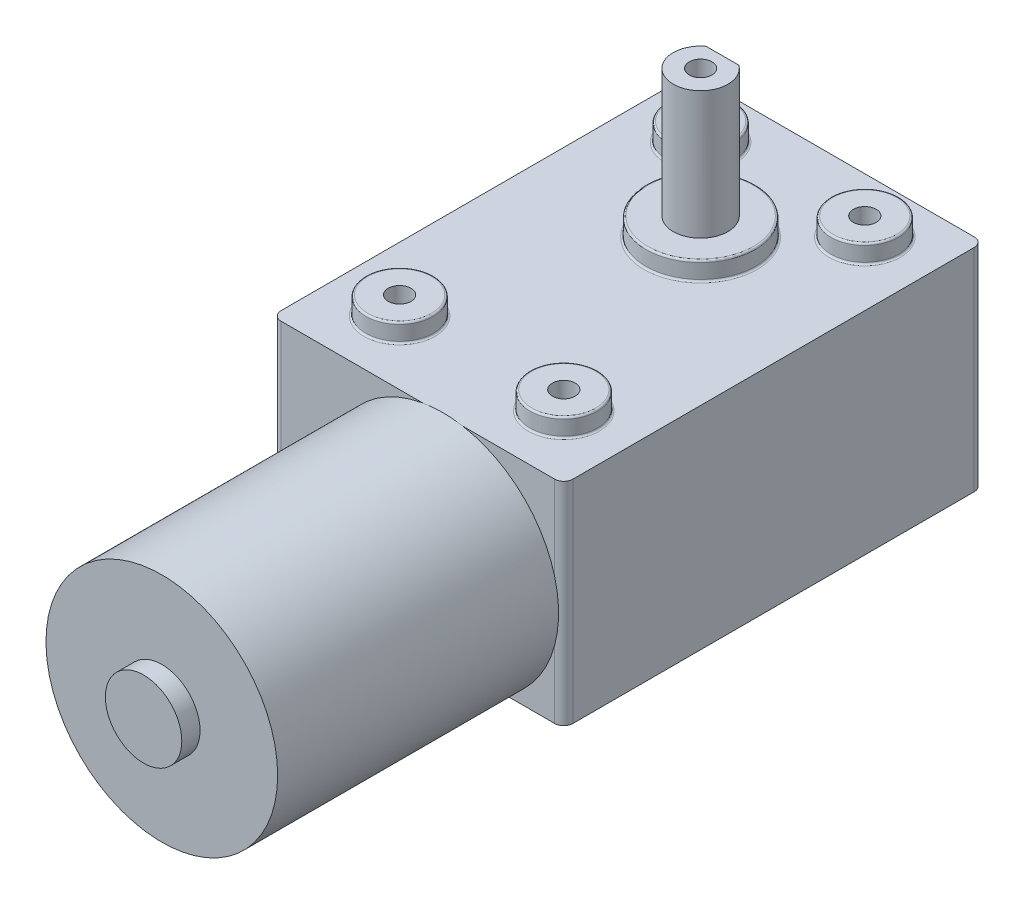
ISO-10303-21;
HEADER;
FILE_DESCRIPTION(('STEP AP214'),'2;1');
FILE_NAME('part.step','',(''),(''),'','','');
FILE_SCHEMA(('AUTOMOTIVE_DESIGN { 1 0 10303 214 1 1 1 1 }'));
ENDSEC;
DATA;
#1=APPLICATION_CONTEXT('core data for automotive mechanical design processes');
#2=APPLICATION_PROTOCOL_DEFINITION('international standard','automotive_design',2000,#1);
#3=PRODUCT_CONTEXT('',#1,'mechanical');
#4=PRODUCT('Part','Part','',(#3));
#5=PRODUCT_RELATED_PRODUCT_CATEGORY('part','',(#4));
#6=PRODUCT_DEFINITION_FORMATION('','',#4);
#7=PRODUCT_DEFINITION_CONTEXT('part definition',#1,'design');
#8=PRODUCT_DEFINITION('design','',#6,#7);
#9=PRODUCT_DEFINITION_SHAPE('','',#8);
#10=(LENGTH_UNIT() NAMED_UNIT(*) SI_UNIT(.MILLI.,.METRE.));
#11=(NAMED_UNIT(*) PLANE_ANGLE_UNIT() SI_UNIT($,.RADIAN.));
#12=(NAMED_UNIT(*) SI_UNIT($,.STERADIAN.) SOLID_ANGLE_UNIT());
#13=UNCERTAINTY_MEASURE_WITH_UNIT(LENGTH_MEASURE(1.E-05),#10,'distance_accuracy_value','');
#14=(GEOMETRIC_REPRESENTATION_CONTEXT(3) GLOBAL_UNCERTAINTY_ASSIGNED_CONTEXT((#13)) GLOBAL_UNIT_ASSIGNED_CONTEXT((#10,
#11,#12)) REPRESENTATION_CONTEXT('',''));
#15=CARTESIAN_POINT('',(0.,0.,0.));
#16=DIRECTION('',(0.,0.,1.));
#17=DIRECTION('',(1.,0.,0.));
#18=AXIS2_PLACEMENT_3D('',#15,#16,#17);
#19=CARTESIAN_POINT('',(0.,23.2,0.));
#20=DIRECTION('',(0.,0.,-1.));
#21=DIRECTION('',(-1.,0.,0.));
#22=AXIS2_PLACEMENT_3D('',#19,#20,#21);
#23=PLANE('',#22);
#24=CARTESIAN_POINT('',(18.7297984360643,10.6881933027604,0.));
#25=DIRECTION('',(0.,0.,1.));
#26=DIRECTION('',(1.,0.,0.));
#27=AXIS2_PLACEMENT_3D('',#24,#25,#26);
#28=CIRCLE('',#27,12.7);
#29=CARTESIAN_POINT('',(25.5892826676103,0.,0.));
#30=VERTEX_POINT('',#29);
#31=CARTESIAN_POINT('',(31.,7.4121967245584,0.));
#32=VERTEX_POINT('',#31);
#33=EDGE_CURVE('E176',#30,#32,#28,.T.);
#34=ORIENTED_EDGE('',*,*,#33,.F.);
#35=DIRECTION('',(1.,0.,0.));
#36=VECTOR('',#35,1.);
#37=CARTESIAN_POINT('',(0.,0.,0.));
#38=LINE('',#37,#36);
#39=CARTESIAN_POINT('',(31.,-1.2490009027033E-13,0.));
#40=VERTEX_POINT('',#39);
#41=EDGE_CURVE('E252',#30,#40,#38,.T.);
#42=ORIENTED_EDGE('',*,*,#41,.T.);
#43=DIRECTION('',(0.,-1.,0.));
#44=VECTOR('',#43,1.);
#45=CARTESIAN_POINT('',(31.,23.2,0.));
#46=LINE('',#45,#44);
#47=EDGE_CURVE('E159',#40,#32,#46,.F.);
#48=ORIENTED_EDGE('',*,*,#47,.T.);
#49=EDGE_LOOP('',(#34,#42,#48));
#50=FACE_BOUND('',#49,.T.);
#51=ADVANCED_FACE('F36',(#50),#23,.F.);
#52=CARTESIAN_POINT('',(31.,13.9641898809621,0.));
#53=VERTEX_POINT('',#52);
#54=CARTESIAN_POINT('',(20.9080300975067,23.2,0.));
#55=VERTEX_POINT('',#54);
#56=EDGE_CURVE('E161',#53,#55,#28,.T.);
#57=ORIENTED_EDGE('',*,*,#56,.F.);
#58=CARTESIAN_POINT('',(31.,23.2,0.));
#59=VERTEX_POINT('',#58);
#60=EDGE_CURVE('E149',#53,#59,#46,.F.);
#61=ORIENTED_EDGE('',*,*,#60,.T.);
#62=DIRECTION('',(1.,0.,0.));
#63=VECTOR('',#62,1.);
#64=CARTESIAN_POINT('',(0.,23.2,0.));
#65=LINE('',#64,#63);
#66=EDGE_CURVE('E52',#55,#59,#65,.T.);
#67=ORIENTED_EDGE('',*,*,#66,.F.);
#68=EDGE_LOOP('',(#57,#61,#67));
#69=FACE_BOUND('',#68,.T.);
#70=ADVANCED_FACE('F162',(#69),#23,.F.);
#71=CARTESIAN_POINT('',(0.,23.2,0.));
#72=DIRECTION('',(1.,0.,0.));
#73=DIRECTION('',(0.,0.,-1.));
#74=AXIS2_PLACEMENT_3D('',#71,#72,#73);
#75=PLANE('',#74);
#76=DIRECTION('',(0.,0.,1.));
#77=VECTOR('',#76,1.);
#78=CARTESIAN_POINT('',(0.,23.2,0.));
#79=LINE('',#78,#77);
#80=CARTESIAN_POINT('',(0.,23.2,-45.));
#81=VERTEX_POINT('',#80);
#82=CARTESIAN_POINT('',(0.,23.2,-1.));
#83=VERTEX_POINT('',#82);
#84=EDGE_CURVE('E239',#81,#83,#79,.T.);
#85=ORIENTED_EDGE('',*,*,#84,.F.);
#86=DIRECTION('',(0.,-1.,0.));
#87=VECTOR('',#86,1.);
#88=CARTESIAN_POINT('',(0.,23.2,-45.));
#89=LINE('',#88,#87);
#90=CARTESIAN_POINT('',(0.,0.,-45.));
#91=VERTEX_POINT('',#90);
#92=EDGE_CURVE('E261',#81,#91,#89,.T.);
#93=ORIENTED_EDGE('',*,*,#92,.T.);
#94=DIRECTION('',(0.,0.,1.));
#95=VECTOR('',#94,1.);
#96=CARTESIAN_POINT('',(0.,0.,0.));
#97=LINE('',#96,#95);
#98=CARTESIAN_POINT('',(0.,0.,-1.));
#99=VERTEX_POINT('',#98);
#100=EDGE_CURVE('E233',#91,#99,#97,.T.);
#101=ORIENTED_EDGE('',*,*,#100,.T.);
#102=DIRECTION('',(0.,-1.,0.));
#103=VECTOR('',#102,1.);
#104=CARTESIAN_POINT('',(0.,23.2,-1.));
#105=LINE('',#104,#103);
#106=EDGE_CURVE('E237',#99,#83,#105,.F.);
#107=ORIENTED_EDGE('',*,*,#106,.T.);
#108=EDGE_LOOP('',(#85,#93,#101,#107));
#109=FACE_BOUND('',#108,.T.);
#110=ADVANCED_FACE('F393',(#109),#75,.F.);
#111=CARTESIAN_POINT('',(16.5515667746219,23.2,0.));
#112=VERTEX_POINT('',#111);
#113=CARTESIAN_POINT('',(11.8703142045183,0.,0.));
#114=VERTEX_POINT('',#113);
#115=EDGE_CURVE('E60',#112,#114,#28,.T.);
#116=ORIENTED_EDGE('',*,*,#115,.F.);
#117=CARTESIAN_POINT('',(0.999999999999999,23.2,0.));
#118=VERTEX_POINT('',#117);
#119=EDGE_CURVE('E243',#118,#112,#65,.T.);
#120=ORIENTED_EDGE('',*,*,#119,.F.);
#121=DIRECTION('',(0.,-1.,0.));
#122=VECTOR('',#121,1.);
#123=CARTESIAN_POINT('',(0.999999999999999,23.2,0.));
#124=LINE('',#123,#122);
#125=CARTESIAN_POINT('',(1.,0.,0.));
#126=VERTEX_POINT('',#125);
#127=EDGE_CURVE('E284',#118,#126,#124,.T.);
#128=ORIENTED_EDGE('',*,*,#127,.T.);
#129=EDGE_CURVE('E253',#126,#114,#38,.T.);
#130=ORIENTED_EDGE('',*,*,#129,.T.);
#131=EDGE_LOOP('',(#116,#120,#128,#130));
#132=FACE_BOUND('',#131,.T.);
#133=ADVANCED_FACE('F389',(#132),#23,.F.);
#134=CARTESIAN_POINT('',(32.,23.2,0.));
#135=DIRECTION('',(-1.,0.,0.));
#136=DIRECTION('',(0.,0.,1.));
#137=AXIS2_PLACEMENT_3D('',#134,#135,#136);
#138=PLANE('',#137);
#139=DIRECTION('',(0.,0.,-1.));
#140=VECTOR('',#139,1.);
#141=CARTESIAN_POINT('',(32.,0.,0.));
#142=LINE('',#141,#140);
#143=CARTESIAN_POINT('',(32.,0.,-1.));
#144=VERTEX_POINT('',#143);
#145=CARTESIAN_POINT('',(32.,0.,-45.));
#146=VERTEX_POINT('',#145);
#147=EDGE_CURVE('E255',#144,#146,#142,.T.);
#148=ORIENTED_EDGE('',*,*,#147,.T.);
#149=DIRECTION('',(0.,-1.,0.));
#150=VECTOR('',#149,1.);
#151=CARTESIAN_POINT('',(32.,23.2,-45.));
#152=LINE('',#151,#150);
#153=CARTESIAN_POINT('',(32.,23.2,-45.));
#154=VERTEX_POINT('',#153);
#155=EDGE_CURVE('E290',#146,#154,#152,.F.);
#156=ORIENTED_EDGE('',*,*,#155,.T.);
#157=DIRECTION('',(0.,0.,-1.));
#158=VECTOR('',#157,1.);
#159=CARTESIAN_POINT('',(32.,23.2,0.));
#160=LINE('',#159,#158);
#161=CARTESIAN_POINT('',(32.,23.2,-1.));
#162=VERTEX_POINT('',#161);
#163=EDGE_CURVE('E245',#162,#154,#160,.T.);
#164=ORIENTED_EDGE('',*,*,#163,.F.);
#165=DIRECTION('',(0.,-1.,0.));
#166=VECTOR('',#165,1.);
#167=CARTESIAN_POINT('',(32.,23.2,-1.));
#168=LINE('',#167,#166);
#169=EDGE_CURVE('E287',#162,#144,#168,.T.);
#170=ORIENTED_EDGE('',*,*,#169,.T.);
#171=EDGE_LOOP('',(#148,#156,#164,#170));
#172=FACE_BOUND('',#171,.T.);
#173=ADVANCED_FACE('F397',(#172),#138,.F.);
#174=CARTESIAN_POINT('',(0.,23.2,-46.));
#175=DIRECTION('',(0.,0.,1.));
#176=DIRECTION('',(1.,0.,0.));
#177=AXIS2_PLACEMENT_3D('',#174,#175,#176);
#178=PLANE('',#177);
#179=DIRECTION('',(-1.,0.,0.));
#180=VECTOR('',#179,1.);
#181=CARTESIAN_POINT('',(0.,0.,-46.));
#182=LINE('',#181,#180);
#183=CARTESIAN_POINT('',(31.,-1.2490009027033E-13,-46.));
#184=VERTEX_POINT('',#183);
#185=CARTESIAN_POINT('',(1.00000000000001,-1.2490009027033E-13,-46.));
#186=VERTEX_POINT('',#185);
#187=EDGE_CURVE('E242',#184,#186,#182,.T.);
#188=ORIENTED_EDGE('',*,*,#187,.T.);
#189=DIRECTION('',(0.,-1.,0.));
#190=VECTOR('',#189,1.);
#191=CARTESIAN_POINT('',(1.00000000000001,23.2,-46.));
#192=LINE('',#191,#190);
#193=CARTESIAN_POINT('',(1.00000000000001,23.2,-46.));
#194=VERTEX_POINT('',#193);
#195=EDGE_CURVE('E276',#186,#194,#192,.F.);
#196=ORIENTED_EDGE('',*,*,#195,.T.);
#197=DIRECTION('',(-1.,0.,0.));
#198=VECTOR('',#197,1.);
#199=CARTESIAN_POINT('',(0.,23.2,-46.));
#200=LINE('',#199,#198);
#201=CARTESIAN_POINT('',(31.,23.1999999999999,-46.));
#202=VERTEX_POINT('',#201);
#203=EDGE_CURVE('E238',#202,#194,#200,.T.);
#204=ORIENTED_EDGE('',*,*,#203,.F.);
#205=DIRECTION('',(0.,-1.,0.));
#206=VECTOR('',#205,1.);
#207=CARTESIAN_POINT('',(31.,23.1999999999999,-46.));
#208=LINE('',#207,#206);
#209=EDGE_CURVE('E273',#202,#184,#208,.T.);
#210=ORIENTED_EDGE('',*,*,#209,.T.);
#211=EDGE_LOOP('',(#188,#196,#204,#210));
#212=FACE_BOUND('',#211,.T.);
#213=ADVANCED_FACE('F402',(#212),#178,.F.);
#214=CARTESIAN_POINT('',(0.,23.2,0.));
#215=DIRECTION('',(0.,-1.,0.));
#216=DIRECTION('',(0.,0.,-1.));
#217=AXIS2_PLACEMENT_3D('',#214,#215,#216);
#218=PLANE('',#217);
#219=CARTESIAN_POINT('',(16.,23.2,-31.));
#220=DIRECTION('',(0.,-1.,0.));
#221=DIRECTION('',(0.,0.,-1.));
#222=AXIS2_PLACEMENT_3D('',#219,#220,#221);
#223=CIRCLE('',#222,6.2);
#224=CARTESIAN_POINT('',(16.,23.2,-37.2));
#225=VERTEX_POINT('',#224);
#226=EDGE_CURVE('E313',#225,#225,#223,.T.);
#227=ORIENTED_EDGE('',*,*,#226,.T.);
#228=EDGE_LOOP('',(#227));
#229=FACE_BOUND('',#228,.T.);
#230=CARTESIAN_POINT('',(7.00000000000001,23.2,-40.));
#231=DIRECTION('',(0.,-1.,0.));
#232=DIRECTION('',(0.,0.,-1.));
#233=AXIS2_PLACEMENT_3D('',#230,#231,#232);
#234=CIRCLE('',#233,3.9);
#235=CARTESIAN_POINT('',(7.00000000000001,23.2,-43.9));
#236=VERTEX_POINT('',#235);
#237=EDGE_CURVE('E310',#236,#236,#234,.T.);
#238=ORIENTED_EDGE('',*,*,#237,.T.);
#239=EDGE_LOOP('',(#238));
#240=FACE_BOUND('',#239,.T.);
#241=CARTESIAN_POINT('',(25.,23.2,-40.));
#242=DIRECTION('',(0.,-1.,0.));
#243=DIRECTION('',(0.,0.,-1.));
#244=AXIS2_PLACEMENT_3D('',#241,#242,#243);
#245=CIRCLE('',#244,3.9);
#246=CARTESIAN_POINT('',(25.,23.2,-43.9));
#247=VERTEX_POINT('',#246);
#248=EDGE_CURVE('E307',#247,#247,#245,.T.);
#249=ORIENTED_EDGE('',*,*,#248,.T.);
#250=EDGE_LOOP('',(#249));
#251=FACE_BOUND('',#250,.T.);
#252=CARTESIAN_POINT('',(7.00000000000001,23.2,-7.));
#253=DIRECTION('',(0.,-1.,0.));
#254=DIRECTION('',(0.,0.,-1.));
#255=AXIS2_PLACEMENT_3D('',#252,#253,#254);
#256=CIRCLE('',#255,3.9);
#257=CARTESIAN_POINT('',(7.00000000000001,23.2,-10.9));
#258=VERTEX_POINT('',#257);
#259=EDGE_CURVE('E304',#258,#258,#256,.T.);
#260=ORIENTED_EDGE('',*,*,#259,.T.);
#261=EDGE_LOOP('',(#260));
#262=FACE_BOUND('',#261,.T.);
#263=CARTESIAN_POINT('',(25.,23.2,-7.));
#264=DIRECTION('',(0.,-1.,0.));
#265=DIRECTION('',(0.,0.,-1.));
#266=AXIS2_PLACEMENT_3D('',#263,#264,#265);
#267=CIRCLE('',#266,3.9);
#268=CARTESIAN_POINT('',(25.,23.2,-10.9));
#269=VERTEX_POINT('',#268);
#270=EDGE_CURVE('E301',#269,#269,#267,.T.);
#271=ORIENTED_EDGE('',*,*,#270,.T.);
#272=EDGE_LOOP('',(#271));
#273=FACE_BOUND('',#272,.T.);
#274=ORIENTED_EDGE('',*,*,#203,.T.);
#275=CARTESIAN_POINT('',(1.00000000000001,23.2,-45.));
#276=DIRECTION('',(0.,-1.,0.));
#277=DIRECTION('',(0.,0.,-1.));
#278=AXIS2_PLACEMENT_3D('',#275,#276,#277);
#279=CIRCLE('',#278,1.);
#280=EDGE_CURVE('E157',#194,#81,#279,.F.);
#281=ORIENTED_EDGE('',*,*,#280,.T.);
#282=ORIENTED_EDGE('',*,*,#84,.T.);
#283=CARTESIAN_POINT('',(1.00000000000001,23.2,-1.));
#284=DIRECTION('',(0.,-1.,0.));
#285=DIRECTION('',(0.,0.,-1.));
#286=AXIS2_PLACEMENT_3D('',#283,#284,#285);
#287=CIRCLE('',#286,1.);
#288=EDGE_CURVE('E281',#83,#118,#287,.F.);
#289=ORIENTED_EDGE('',*,*,#288,.T.);
#290=ORIENTED_EDGE('',*,*,#119,.T.);
#291=DIRECTION('',(-1.,0.,0.));
#292=VECTOR('',#291,1.);
#293=CARTESIAN_POINT('',(0.,23.2,0.));
#294=LINE('',#293,#292);
#295=EDGE_CURVE('E185',#55,#112,#294,.T.);
#296=ORIENTED_EDGE('',*,*,#295,.F.);
#297=ORIENTED_EDGE('',*,*,#66,.T.);
#298=CARTESIAN_POINT('',(31.,23.2,-1.));
#299=DIRECTION('',(0.,-1.,0.));
#300=DIRECTION('',(0.,0.,-1.));
#301=AXIS2_PLACEMENT_3D('',#298,#299,#300);
#302=CIRCLE('',#301,1.);
#303=EDGE_CURVE('E156',#59,#162,#302,.F.);
#304=ORIENTED_EDGE('',*,*,#303,.T.);
#305=ORIENTED_EDGE('',*,*,#163,.T.);
#306=CARTESIAN_POINT('',(31.,23.1999999999999,-45.));
#307=DIRECTION('',(0.,-1.,0.));
#308=DIRECTION('',(0.,0.,-1.));
#309=AXIS2_PLACEMENT_3D('',#306,#307,#308);
#310=CIRCLE('',#309,1.);
#311=EDGE_CURVE('E279',#154,#202,#310,.F.);
#312=ORIENTED_EDGE('',*,*,#311,.T.);
#313=EDGE_LOOP('',(#274,#281,#282,#289,#290,#296,#297,#304,#305,#312));
#314=FACE_BOUND('',#313,.T.);
#315=ADVANCED_FACE('F459',(#229,#240,#251,#262,#273,#314),#218,.F.);
#316=CARTESIAN_POINT('',(0.,0.,0.));
#317=DIRECTION('',(0.,-1.,0.));
#318=DIRECTION('',(0.,0.,-1.));
#319=AXIS2_PLACEMENT_3D('',#316,#317,#318);
#320=PLANE('',#319);
#321=ORIENTED_EDGE('',*,*,#100,.F.);
#322=CARTESIAN_POINT('',(1.00000000000001,-1.2490009027033E-13,-45.));
#323=DIRECTION('',(0.,-1.,0.));
#324=DIRECTION('',(0.,0.,-1.));
#325=AXIS2_PLACEMENT_3D('',#322,#323,#324);
#326=CIRCLE('',#325,1.);
#327=EDGE_CURVE('E271',#91,#186,#326,.T.);
#328=ORIENTED_EDGE('',*,*,#327,.T.);
#329=ORIENTED_EDGE('',*,*,#187,.F.);
#330=CARTESIAN_POINT('',(31.,-1.2490009027033E-13,-45.));
#331=DIRECTION('',(0.,-1.,0.));
#332=DIRECTION('',(0.,0.,-1.));
#333=AXIS2_PLACEMENT_3D('',#330,#331,#332);
#334=CIRCLE('',#333,1.);
#335=EDGE_CURVE('E267',#184,#146,#334,.T.);
#336=ORIENTED_EDGE('',*,*,#335,.T.);
#337=ORIENTED_EDGE('',*,*,#147,.F.);
#338=CARTESIAN_POINT('',(31.,-1.2490009027033E-13,-1.));
#339=DIRECTION('',(0.,-1.,0.));
#340=DIRECTION('',(0.,0.,-1.));
#341=AXIS2_PLACEMENT_3D('',#338,#339,#340);
#342=CIRCLE('',#341,1.);
#343=EDGE_CURVE('E264',#144,#40,#342,.T.);
#344=ORIENTED_EDGE('',*,*,#343,.T.);
#345=ORIENTED_EDGE('',*,*,#41,.F.);
#346=DIRECTION('',(-1.,0.,0.));
#347=VECTOR('',#346,1.);
#348=CARTESIAN_POINT('',(0.,0.,0.));
#349=LINE('',#348,#347);
#350=EDGE_CURVE('E183',#30,#114,#349,.T.);
#351=ORIENTED_EDGE('',*,*,#350,.T.);
#352=ORIENTED_EDGE('',*,*,#129,.F.);
#353=CARTESIAN_POINT('',(1.00000000000002,0.,-1.));
#354=DIRECTION('',(0.,-1.,0.));
#355=DIRECTION('',(0.,0.,-1.));
#356=AXIS2_PLACEMENT_3D('',#353,#354,#355);
#357=CIRCLE('',#356,1.);
#358=EDGE_CURVE('E269',#126,#99,#357,.T.);
#359=ORIENTED_EDGE('',*,*,#358,.T.);
#360=EDGE_LOOP('',(#321,#328,#329,#336,#337,#344,#345,#351,#352,#359));
#361=FACE_BOUND('',#360,.T.);
#362=ADVANCED_FACE('F462',(#361),#320,.T.);
#363=CARTESIAN_POINT('',(7.00000000000001,25.2,-40.));
#364=DIRECTION('',(0.,-1.,0.));
#365=DIRECTION('',(0.,0.,-1.));
#366=AXIS2_PLACEMENT_3D('',#363,#364,#365);
#367=CYLINDRICAL_SURFACE('',#366,3.7);
#368=CARTESIAN_POINT('',(7.00000000000001,25.,-40.));
#369=DIRECTION('',(0.,1.,0.));
#370=DIRECTION('',(0.,0.,1.));
#371=AXIS2_PLACEMENT_3D('',#368,#369,#370);
#372=CIRCLE('',#371,3.7);
#373=CARTESIAN_POINT('',(7.00000000000001,25.,-36.3));
#374=VERTEX_POINT('',#373);
#375=EDGE_CURVE('E322',#374,#374,#372,.F.);
#376=ORIENTED_EDGE('',*,*,#375,.T.);
#377=EDGE_LOOP('',(#376));
#378=FACE_BOUND('',#377,.T.);
#379=CARTESIAN_POINT('',(7.00000000000001,23.4,-40.));
#380=DIRECTION('',(0.,-1.,0.));
#381=DIRECTION('',(0.,0.,-1.));
#382=AXIS2_PLACEMENT_3D('',#379,#380,#381);
#383=CIRCLE('',#382,3.7);
#384=CARTESIAN_POINT('',(7.00000000000001,23.4,-43.7));
#385=VERTEX_POINT('',#384);
#386=EDGE_CURVE('E319',#385,#385,#383,.F.);
#387=ORIENTED_EDGE('',*,*,#386,.T.);
#388=EDGE_LOOP('',(#387));
#389=FACE_BOUND('',#388,.T.);
#390=ADVANCED_FACE('F497',(#378,#389),#367,.T.);
#391=CARTESIAN_POINT('',(7.00000000000001,25.2,-40.));
#392=DIRECTION('',(0.,1.,0.));
#393=DIRECTION('',(0.,0.,1.));
#394=AXIS2_PLACEMENT_3D('',#391,#392,#393);
#395=PLANE('',#394);
#396=CARTESIAN_POINT('',(7.00000000000001,25.2,-40.));
#397=DIRECTION('',(0.,1.,0.));
#398=DIRECTION('',(0.,0.,1.));
#399=AXIS2_PLACEMENT_3D('',#396,#397,#398);
#400=CIRCLE('',#399,3.5);
#401=CARTESIAN_POINT('',(7.00000000000001,25.2,-36.5));
#402=VERTEX_POINT('',#401);
#403=EDGE_CURVE('E316',#402,#402,#400,.T.);
#404=ORIENTED_EDGE('',*,*,#403,.T.);
#405=EDGE_LOOP('',(#404));
#406=FACE_BOUND('',#405,.T.);
#407=CARTESIAN_POINT('',(7.00000000000001,25.2,-40.));
#408=DIRECTION('',(0.,1.,0.));
#409=DIRECTION('',(0.,0.,1.));
#410=AXIS2_PLACEMENT_3D('',#407,#408,#409);
#411=CIRCLE('',#410,1.24999999999999);
#412=CARTESIAN_POINT('',(7.00000000000001,25.2,-38.75));
#413=VERTEX_POINT('',#412);
#414=EDGE_CURVE('E200',#413,#413,#411,.T.);
#415=ORIENTED_EDGE('',*,*,#414,.F.);
#416=EDGE_LOOP('',(#415));
#417=FACE_BOUND('',#416,.T.);
#418=ADVANCED_FACE('F501',(#406,#417),#395,.T.);
#419=CARTESIAN_POINT('',(25.,25.2,-40.));
#420=DIRECTION('',(0.,-1.,0.));
#421=DIRECTION('',(0.,0.,-1.));
#422=AXIS2_PLACEMENT_3D('',#419,#420,#421);
#423=CYLINDRICAL_SURFACE('',#422,3.7);
#424=CARTESIAN_POINT('',(25.,25.,-39.9999999999999));
#425=DIRECTION('',(0.,1.,0.));
#426=DIRECTION('',(0.,0.,1.));
#427=AXIS2_PLACEMENT_3D('',#424,#425,#426);
#428=CIRCLE('',#427,3.7);
#429=CARTESIAN_POINT('',(25.,25.,-36.2999999999999));
#430=VERTEX_POINT('',#429);
#431=EDGE_CURVE('E331',#430,#430,#428,.F.);
#432=ORIENTED_EDGE('',*,*,#431,.T.);
#433=EDGE_LOOP('',(#432));
#434=FACE_BOUND('',#433,.T.);
#435=CARTESIAN_POINT('',(25.,23.4,-40.));
#436=DIRECTION('',(0.,-1.,0.));
#437=DIRECTION('',(0.,0.,-1.));
#438=AXIS2_PLACEMENT_3D('',#435,#436,#437);
#439=CIRCLE('',#438,3.7);
#440=CARTESIAN_POINT('',(25.,23.4,-43.7));
#441=VERTEX_POINT('',#440);
#442=EDGE_CURVE('E328',#441,#441,#439,.F.);
#443=ORIENTED_EDGE('',*,*,#442,.T.);
#444=EDGE_LOOP('',(#443));
#445=FACE_BOUND('',#444,.T.);
#446=ADVANCED_FACE('F505',(#434,#445),#423,.T.);
#447=CARTESIAN_POINT('',(25.,25.2,-40.));
#448=DIRECTION('',(0.,1.,0.));
#449=DIRECTION('',(0.,0.,1.));
#450=AXIS2_PLACEMENT_3D('',#447,#448,#449);
#451=PLANE('',#450);
#452=CARTESIAN_POINT('',(25.,25.2,-40.));
#453=DIRECTION('',(0.,1.,0.));
#454=DIRECTION('',(0.,0.,1.));
#455=AXIS2_PLACEMENT_3D('',#452,#453,#454);
#456=CIRCLE('',#455,3.5);
#457=CARTESIAN_POINT('',(25.,25.2,-36.5));
#458=VERTEX_POINT('',#457);
#459=EDGE_CURVE('E325',#458,#458,#456,.T.);
#460=ORIENTED_EDGE('',*,*,#459,.T.);
#461=EDGE_LOOP('',(#460));
#462=FACE_BOUND('',#461,.T.);
#463=CARTESIAN_POINT('',(25.,25.2,-40.));
#464=DIRECTION('',(0.,1.,0.));
#465=DIRECTION('',(0.,0.,1.));
#466=AXIS2_PLACEMENT_3D('',#463,#464,#465);
#467=CIRCLE('',#466,1.24999999999999);
#468=CARTESIAN_POINT('',(25.,25.2,-38.75));
#469=VERTEX_POINT('',#468);
#470=EDGE_CURVE('E206',#469,#469,#467,.T.);
#471=ORIENTED_EDGE('',*,*,#470,.F.);
#472=EDGE_LOOP('',(#471));
#473=FACE_BOUND('',#472,.T.);
#474=ADVANCED_FACE('F509',(#462,#473),#451,.T.);
#475=CARTESIAN_POINT('',(7.00000000000001,25.2,-7.));
#476=DIRECTION('',(0.,-1.,0.));
#477=DIRECTION('',(0.,0.,-1.));
#478=AXIS2_PLACEMENT_3D('',#475,#476,#477);
#479=CYLINDRICAL_SURFACE('',#478,3.7);
#480=CARTESIAN_POINT('',(7.00000000000001,25.,-7.));
#481=DIRECTION('',(0.,1.,0.));
#482=DIRECTION('',(0.,0.,1.));
#483=AXIS2_PLACEMENT_3D('',#480,#481,#482);
#484=CIRCLE('',#483,3.7);
#485=CARTESIAN_POINT('',(7.00000000000001,25.,-3.3));
#486=VERTEX_POINT('',#485);
#487=EDGE_CURVE('E40',#486,#486,#484,.F.);
#488=ORIENTED_EDGE('',*,*,#487,.T.);
#489=EDGE_LOOP('',(#488));
#490=FACE_BOUND('',#489,.T.);
#491=CARTESIAN_POINT('',(7.00000000000001,23.4,-6.99999999999997));
#492=DIRECTION('',(0.,-1.,0.));
#493=DIRECTION('',(0.,0.,-1.));
#494=AXIS2_PLACEMENT_3D('',#491,#492,#493);
#495=CIRCLE('',#494,3.7);
#496=CARTESIAN_POINT('',(7.00000000000001,23.4,-10.7));
#497=VERTEX_POINT('',#496);
#498=EDGE_CURVE('E345',#497,#497,#495,.F.);
#499=ORIENTED_EDGE('',*,*,#498,.T.);
#500=EDGE_LOOP('',(#499));
#501=FACE_BOUND('',#500,.T.);
#502=ADVANCED_FACE('F352',(#490,#501),#479,.T.);
#503=CARTESIAN_POINT('',(7.00000000000001,25.2,-7.));
#504=DIRECTION('',(0.,1.,0.));
#505=DIRECTION('',(0.,0.,1.));
#506=AXIS2_PLACEMENT_3D('',#503,#504,#505);
#507=PLANE('',#506);
#508=CARTESIAN_POINT('',(7.00000000000001,25.2,-7.));
#509=DIRECTION('',(0.,1.,0.));
#510=DIRECTION('',(0.,0.,1.));
#511=AXIS2_PLACEMENT_3D('',#508,#509,#510);
#512=CIRCLE('',#511,3.5);
#513=CARTESIAN_POINT('',(7.00000000000001,25.2,-3.5));
#514=VERTEX_POINT('',#513);
#515=EDGE_CURVE('E343',#514,#514,#512,.T.);
#516=ORIENTED_EDGE('',*,*,#515,.T.);
#517=EDGE_LOOP('',(#516));
#518=FACE_BOUND('',#517,.T.);
#519=CARTESIAN_POINT('',(7.00000000000001,25.2,-7.));
#520=DIRECTION('',(0.,1.,0.));
#521=DIRECTION('',(0.,0.,1.));
#522=AXIS2_PLACEMENT_3D('',#519,#520,#521);
#523=CIRCLE('',#522,1.24999999999999);
#524=CARTESIAN_POINT('',(7.00000000000001,25.2,-5.75000000000001));
#525=VERTEX_POINT('',#524);
#526=EDGE_CURVE('E194',#525,#525,#523,.T.);
#527=ORIENTED_EDGE('',*,*,#526,.F.);
#528=EDGE_LOOP('',(#527));
#529=FACE_BOUND('',#528,.T.);
#530=ADVANCED_FACE('F362',(#518,#529),#507,.T.);
#531=CARTESIAN_POINT('',(25.,25.2,-7.));
#532=DIRECTION('',(0.,-1.,0.));
#533=DIRECTION('',(0.,0.,-1.));
#534=AXIS2_PLACEMENT_3D('',#531,#532,#533);
#535=CYLINDRICAL_SURFACE('',#534,3.7);
#536=CARTESIAN_POINT('',(25.,25.,-7.));
#537=DIRECTION('',(0.,1.,0.));
#538=DIRECTION('',(0.,0.,1.));
#539=AXIS2_PLACEMENT_3D('',#536,#537,#538);
#540=CIRCLE('',#539,3.7);
#541=CARTESIAN_POINT('',(25.,25.,-3.3));
#542=VERTEX_POINT('',#541);
#543=EDGE_CURVE('E340',#542,#542,#540,.F.);
#544=ORIENTED_EDGE('',*,*,#543,.T.);
#545=EDGE_LOOP('',(#544));
#546=FACE_BOUND('',#545,.T.);
#547=CARTESIAN_POINT('',(25.,23.4,-7.));
#548=DIRECTION('',(0.,-1.,0.));
#549=DIRECTION('',(0.,0.,-1.));
#550=AXIS2_PLACEMENT_3D('',#547,#548,#549);
#551=CIRCLE('',#550,3.7);
#552=CARTESIAN_POINT('',(25.,23.4,-10.7));
#553=VERTEX_POINT('',#552);
#554=EDGE_CURVE('E337',#553,#553,#551,.F.);
#555=ORIENTED_EDGE('',*,*,#554,.T.);
#556=EDGE_LOOP('',(#555));
#557=FACE_BOUND('',#556,.T.);
#558=ADVANCED_FACE('F365',(#546,#557),#535,.T.);
#559=CARTESIAN_POINT('',(25.,25.2,-7.));
#560=DIRECTION('',(0.,1.,0.));
#561=DIRECTION('',(0.,0.,1.));
#562=AXIS2_PLACEMENT_3D('',#559,#560,#561);
#563=PLANE('',#562);
#564=CARTESIAN_POINT('',(25.,25.2,-7.));
#565=DIRECTION('',(0.,1.,0.));
#566=DIRECTION('',(0.,0.,1.));
#567=AXIS2_PLACEMENT_3D('',#564,#565,#566);
#568=CIRCLE('',#567,3.5);
#569=CARTESIAN_POINT('',(25.,25.2,-3.5));
#570=VERTEX_POINT('',#569);
#571=EDGE_CURVE('E334',#570,#570,#568,.T.);
#572=ORIENTED_EDGE('',*,*,#571,.T.);
#573=EDGE_LOOP('',(#572));
#574=FACE_BOUND('',#573,.T.);
#575=CARTESIAN_POINT('',(25.,25.2,-7.));
#576=DIRECTION('',(0.,1.,0.));
#577=DIRECTION('',(0.,0.,1.));
#578=AXIS2_PLACEMENT_3D('',#575,#576,#577);
#579=CIRCLE('',#578,1.24999999999999);
#580=CARTESIAN_POINT('',(25.,25.2,-5.75000000000001));
#581=VERTEX_POINT('',#580);
#582=EDGE_CURVE('E188',#581,#581,#579,.T.);
#583=ORIENTED_EDGE('',*,*,#582,.F.);
#584=EDGE_LOOP('',(#583));
#585=FACE_BOUND('',#584,.T.);
#586=ADVANCED_FACE('F518',(#574,#585),#563,.T.);
#587=CARTESIAN_POINT('',(16.,25.2,-31.));
#588=DIRECTION('',(0.,-1.,0.));
#589=DIRECTION('',(0.,0.,-1.));
#590=AXIS2_PLACEMENT_3D('',#587,#588,#589);
#591=CYLINDRICAL_SURFACE('',#590,6.);
#592=CARTESIAN_POINT('',(16.,25.,-31.));
#593=DIRECTION('',(0.,1.,0.));
#594=DIRECTION('',(0.,0.,1.));
#595=AXIS2_PLACEMENT_3D('',#592,#593,#594);
#596=CIRCLE('',#595,6.);
#597=CARTESIAN_POINT('',(16.,25.,-25.));
#598=VERTEX_POINT('',#597);
#599=EDGE_CURVE('E298',#598,#598,#596,.F.);
#600=ORIENTED_EDGE('',*,*,#599,.T.);
#601=EDGE_LOOP('',(#600));
#602=FACE_BOUND('',#601,.T.);
#603=CARTESIAN_POINT('',(16.,23.4,-31.));
#604=DIRECTION('',(0.,-1.,0.));
#605=DIRECTION('',(0.,0.,-1.));
#606=AXIS2_PLACEMENT_3D('',#603,#604,#605);
#607=CIRCLE('',#606,6.);
#608=CARTESIAN_POINT('',(16.,23.4,-37.));
#609=VERTEX_POINT('',#608);
#610=EDGE_CURVE('E295',#609,#609,#607,.F.);
#611=ORIENTED_EDGE('',*,*,#610,.T.);
#612=EDGE_LOOP('',(#611));
#613=FACE_BOUND('',#612,.T.);
#614=ADVANCED_FACE('F522',(#602,#613),#591,.T.);
#615=CARTESIAN_POINT('',(16.,25.2,-31.));
#616=DIRECTION('',(0.,1.,0.));
#617=DIRECTION('',(0.,0.,1.));
#618=AXIS2_PLACEMENT_3D('',#615,#616,#617);
#619=PLANE('',#618);
#620=CARTESIAN_POINT('',(16.,25.2,-31.));
#621=DIRECTION('',(0.,1.,0.));
#622=DIRECTION('',(0.,0.,1.));
#623=AXIS2_PLACEMENT_3D('',#620,#621,#622);
#624=CIRCLE('',#623,5.8);
#625=CARTESIAN_POINT('',(16.,25.2,-25.2));
#626=VERTEX_POINT('',#625);
#627=EDGE_CURVE('E292',#626,#626,#624,.T.);
#628=ORIENTED_EDGE('',*,*,#627,.T.);
#629=EDGE_LOOP('',(#628));
#630=FACE_BOUND('',#629,.T.);
#631=CARTESIAN_POINT('',(16.,25.2,-31.));
#632=DIRECTION('',(0.,1.,0.));
#633=DIRECTION('',(0.,0.,1.));
#634=AXIS2_PLACEMENT_3D('',#631,#632,#633);
#635=CIRCLE('',#634,3.);
#636=CARTESIAN_POINT('',(16.,25.2,-28.));
#637=VERTEX_POINT('',#636);
#638=EDGE_CURVE('E234',#637,#637,#635,.T.);
#639=ORIENTED_EDGE('',*,*,#638,.F.);
#640=EDGE_LOOP('',(#639));
#641=FACE_BOUND('',#640,.T.);
#642=ADVANCED_FACE('F526',(#630,#641),#619,.T.);
#643=CARTESIAN_POINT('',(16.,39.2,-31.));
#644=DIRECTION('',(0.,-1.,0.));
#645=DIRECTION('',(0.,0.,-1.));
#646=AXIS2_PLACEMENT_3D('',#643,#644,#645);
#647=CYLINDRICAL_SURFACE('',#646,3.);
#648=CARTESIAN_POINT('',(16.,39.2,-31.));
#649=DIRECTION('',(0.,1.,0.));
#650=DIRECTION('',(0.,0.,1.));
#651=AXIS2_PLACEMENT_3D('',#648,#649,#650);
#652=CIRCLE('',#651,3.);
#653=CARTESIAN_POINT('',(14.2,39.2,-33.4));
#654=VERTEX_POINT('',#653);
#655=CARTESIAN_POINT('',(17.8,39.1999999999998,-33.4));
#656=VERTEX_POINT('',#655);
#657=EDGE_CURVE('E230',#654,#656,#652,.T.);
#658=ORIENTED_EDGE('',*,*,#657,.F.);
#659=DIRECTION('',(0.,1.,0.));
#660=VECTOR('',#659,1.);
#661=CARTESIAN_POINT('',(14.2,27.2,-33.4));
#662=LINE('',#661,#660);
#663=CARTESIAN_POINT('',(14.2,27.2,-33.4));
#664=VERTEX_POINT('',#663);
#665=EDGE_CURVE('E218',#664,#654,#662,.T.);
#666=ORIENTED_EDGE('',*,*,#665,.F.);
#667=CARTESIAN_POINT('',(16.,27.2,-31.));
#668=DIRECTION('',(0.,1.,0.));
#669=DIRECTION('',(0.,0.,-1.));
#670=AXIS2_PLACEMENT_3D('',#667,#668,#669);
#671=CIRCLE('',#670,3.);
#672=CARTESIAN_POINT('',(17.8,27.1999999999998,-33.4));
#673=VERTEX_POINT('',#672);
#674=EDGE_CURVE('E213',#673,#664,#671,.T.);
#675=ORIENTED_EDGE('',*,*,#674,.F.);
#676=DIRECTION('',(0.,1.,0.));
#677=VECTOR('',#676,1.);
#678=CARTESIAN_POINT('',(17.8,27.1999999999998,-33.4));
#679=LINE('',#678,#677);
#680=EDGE_CURVE('E220',#673,#656,#679,.T.);
#681=ORIENTED_EDGE('',*,*,#680,.T.);
#682=EDGE_LOOP('',(#658,#666,#675,#681));
#683=FACE_BOUND('',#682,.T.);
#684=ORIENTED_EDGE('',*,*,#638,.T.);
#685=EDGE_LOOP('',(#684));
#686=FACE_BOUND('',#685,.T.);
#687=ADVANCED_FACE('F530',(#683,#686),#647,.T.);
#688=CARTESIAN_POINT('',(16.,39.2,-31.));
#689=DIRECTION('',(0.,1.,0.));
#690=DIRECTION('',(0.,0.,1.));
#691=AXIS2_PLACEMENT_3D('',#688,#689,#690);
#692=PLANE('',#691);
#693=DIRECTION('',(1.,0.,0.));
#694=VECTOR('',#693,1.);
#695=CARTESIAN_POINT('',(14.2,39.2,-33.4));
#696=LINE('',#695,#694);
#697=EDGE_CURVE('E212',#654,#656,#696,.T.);
#698=ORIENTED_EDGE('',*,*,#697,.F.);
#699=ORIENTED_EDGE('',*,*,#657,.T.);
#700=EDGE_LOOP('',(#698,#699));
#701=FACE_BOUND('',#700,.T.);
#702=CARTESIAN_POINT('',(16.,39.2,-31.));
#703=DIRECTION('',(0.,1.,0.));
#704=DIRECTION('',(0.,0.,1.));
#705=AXIS2_PLACEMENT_3D('',#702,#703,#704);
#706=CIRCLE('',#705,1.24999999999999);
#707=CARTESIAN_POINT('',(16.,39.2,-29.75));
#708=VERTEX_POINT('',#707);
#709=EDGE_CURVE('E223',#708,#708,#706,.T.);
#710=ORIENTED_EDGE('',*,*,#709,.F.);
#711=EDGE_LOOP('',(#710));
#712=FACE_BOUND('',#711,.T.);
#713=ADVANCED_FACE('F534',(#701,#712),#692,.T.);
#714=CARTESIAN_POINT('',(16.,27.2,-31.));
#715=DIRECTION('',(0.,1.,0.));
#716=DIRECTION('',(0.,0.,1.));
#717=AXIS2_PLACEMENT_3D('',#714,#715,#716);
#718=CONICAL_SURFACE('',#717,1.25,1.02974425867665);
#719=CARTESIAN_POINT('',(16.,26.4489242262155,-31.));
#720=VERTEX_POINT('',#719);
#721=VERTEX_LOOP('',#720);
#722=FACE_BOUND('',#721,.T.);
#723=CARTESIAN_POINT('',(16.,27.2,-31.));
#724=DIRECTION('',(0.,1.,0.));
#725=DIRECTION('',(0.,0.,1.));
#726=AXIS2_PLACEMENT_3D('',#723,#724,#725);
#727=CIRCLE('',#726,1.25);
#728=CARTESIAN_POINT('',(16.,27.2,-29.75));
#729=VERTEX_POINT('',#728);
#730=EDGE_CURVE('E227',#729,#729,#727,.T.);
#731=ORIENTED_EDGE('',*,*,#730,.T.);
#732=EDGE_LOOP('',(#731));
#733=FACE_BOUND('',#732,.T.);
#734=ADVANCED_FACE('F538',(#722,#733),#718,.F.);
#735=CARTESIAN_POINT('',(16.,39.2,-31.));
#736=DIRECTION('',(0.,1.,0.));
#737=DIRECTION('',(0.,0.,1.));
#738=AXIS2_PLACEMENT_3D('',#735,#736,#737);
#739=CYLINDRICAL_SURFACE('',#738,1.24999999999999);
#740=ORIENTED_EDGE('',*,*,#730,.F.);
#741=EDGE_LOOP('',(#740));
#742=FACE_BOUND('',#741,.T.);
#743=ORIENTED_EDGE('',*,*,#709,.T.);
#744=EDGE_LOOP('',(#743));
#745=FACE_BOUND('',#744,.T.);
#746=ADVANCED_FACE('F542',(#742,#745),#739,.F.);
#747=CARTESIAN_POINT('',(14.2,27.2,-33.4));
#748=DIRECTION('',(0.,0.,1.));
#749=DIRECTION('',(1.,0.,0.));
#750=AXIS2_PLACEMENT_3D('',#747,#748,#749);
#751=PLANE('',#750);
#752=ORIENTED_EDGE('',*,*,#697,.T.);
#753=ORIENTED_EDGE('',*,*,#680,.F.);
#754=DIRECTION('',(1.,0.,0.));
#755=VECTOR('',#754,1.);
#756=CARTESIAN_POINT('',(14.2,27.2,-33.4));
#757=LINE('',#756,#755);
#758=EDGE_CURVE('E215',#664,#673,#757,.T.);
#759=ORIENTED_EDGE('',*,*,#758,.F.);
#760=ORIENTED_EDGE('',*,*,#665,.T.);
#761=EDGE_LOOP('',(#752,#753,#759,#760));
#762=FACE_BOUND('',#761,.T.);
#763=ADVANCED_FACE('F546',(#762),#751,.F.);
#764=CARTESIAN_POINT('',(16.,27.2,-31.));
#765=DIRECTION('',(0.,-1.,0.));
#766=DIRECTION('',(0.,0.,-1.));
#767=AXIS2_PLACEMENT_3D('',#764,#765,#766);
#768=PLANE('',#767);
#769=ORIENTED_EDGE('',*,*,#674,.T.);
#770=ORIENTED_EDGE('',*,*,#758,.T.);
#771=EDGE_LOOP('',(#769,#770));
#772=FACE_BOUND('',#771,.T.);
#773=ADVANCED_FACE('F550',(#772),#768,.F.);
#774=CARTESIAN_POINT('',(25.,17.7,-40.));
#775=DIRECTION('',(0.,1.,0.));
#776=DIRECTION('',(0.,0.,1.));
#777=AXIS2_PLACEMENT_3D('',#774,#775,#776);
#778=CONICAL_SURFACE('',#777,1.24999999999999,1.02974425867665);
#779=CARTESIAN_POINT('',(25.,16.9489242262155,-40.));
#780=VERTEX_POINT('',#779);
#781=VERTEX_LOOP('',#780);
#782=FACE_BOUND('',#781,.T.);
#783=CARTESIAN_POINT('',(25.,17.7,-40.));
#784=DIRECTION('',(0.,1.,0.));
#785=DIRECTION('',(0.,0.,1.));
#786=AXIS2_PLACEMENT_3D('',#783,#784,#785);
#787=CIRCLE('',#786,1.24999999999999);
#788=CARTESIAN_POINT('',(25.,17.7,-38.75));
#789=VERTEX_POINT('',#788);
#790=EDGE_CURVE('E209',#789,#789,#787,.T.);
#791=ORIENTED_EDGE('',*,*,#790,.T.);
#792=EDGE_LOOP('',(#791));
#793=FACE_BOUND('',#792,.T.);
#794=ADVANCED_FACE('F554',(#782,#793),#778,.F.);
#795=CARTESIAN_POINT('',(25.,25.2,-40.));
#796=DIRECTION('',(0.,1.,0.));
#797=DIRECTION('',(0.,0.,1.));
#798=AXIS2_PLACEMENT_3D('',#795,#796,#797);
#799=CYLINDRICAL_SURFACE('',#798,1.24999999999999);
#800=ORIENTED_EDGE('',*,*,#790,.F.);
#801=EDGE_LOOP('',(#800));
#802=FACE_BOUND('',#801,.T.);
#803=ORIENTED_EDGE('',*,*,#470,.T.);
#804=EDGE_LOOP('',(#803));
#805=FACE_BOUND('',#804,.T.);
#806=ADVANCED_FACE('F558',(#802,#805),#799,.F.);
#807=CARTESIAN_POINT('',(7.00000000000001,17.7,-40.));
#808=DIRECTION('',(0.,1.,0.));
#809=DIRECTION('',(0.,0.,1.));
#810=AXIS2_PLACEMENT_3D('',#807,#808,#809);
#811=CONICAL_SURFACE('',#810,1.24999999999999,1.02974425867665);
#812=CARTESIAN_POINT('',(7.00000000000001,16.9489242262155,-40.));
#813=VERTEX_POINT('',#812);
#814=VERTEX_LOOP('',#813);
#815=FACE_BOUND('',#814,.T.);
#816=CARTESIAN_POINT('',(7.00000000000001,17.7,-40.));
#817=DIRECTION('',(0.,1.,0.));
#818=DIRECTION('',(0.,0.,1.));
#819=AXIS2_PLACEMENT_3D('',#816,#817,#818);
#820=CIRCLE('',#819,1.24999999999999);
#821=CARTESIAN_POINT('',(7.00000000000001,17.7,-38.75));
#822=VERTEX_POINT('',#821);
#823=EDGE_CURVE('E203',#822,#822,#820,.T.);
#824=ORIENTED_EDGE('',*,*,#823,.T.);
#825=EDGE_LOOP('',(#824));
#826=FACE_BOUND('',#825,.T.);
#827=ADVANCED_FACE('F562',(#815,#826),#811,.F.);
#828=CARTESIAN_POINT('',(7.00000000000001,25.2,-40.));
#829=DIRECTION('',(0.,1.,0.));
#830=DIRECTION('',(0.,0.,1.));
#831=AXIS2_PLACEMENT_3D('',#828,#829,#830);
#832=CYLINDRICAL_SURFACE('',#831,1.24999999999999);
#833=ORIENTED_EDGE('',*,*,#823,.F.);
#834=EDGE_LOOP('',(#833));
#835=FACE_BOUND('',#834,.T.);
#836=ORIENTED_EDGE('',*,*,#414,.T.);
#837=EDGE_LOOP('',(#836));
#838=FACE_BOUND('',#837,.T.);
#839=ADVANCED_FACE('F382',(#835,#838),#832,.F.);
#840=CARTESIAN_POINT('',(7.00000000000001,17.7,-6.99999999999997));
#841=DIRECTION('',(0.,1.,0.));
#842=DIRECTION('',(0.,0.,1.));
#843=AXIS2_PLACEMENT_3D('',#840,#841,#842);
#844=CONICAL_SURFACE('',#843,1.24999999999999,1.02974425867665);
#845=CARTESIAN_POINT('',(7.00000000000001,16.9489242262155,-6.99999999999997));
#846=VERTEX_POINT('',#845);
#847=VERTEX_LOOP('',#846);
#848=FACE_BOUND('',#847,.T.);
#849=CARTESIAN_POINT('',(7.00000000000001,17.7,-6.99999999999997));
#850=DIRECTION('',(0.,1.,0.));
#851=DIRECTION('',(0.,0.,1.));
#852=AXIS2_PLACEMENT_3D('',#849,#850,#851);
#853=CIRCLE('',#852,1.24999999999999);
#854=CARTESIAN_POINT('',(7.00000000000001,17.7,-5.74999999999998));
#855=VERTEX_POINT('',#854);
#856=EDGE_CURVE('E197',#855,#855,#853,.T.);
#857=ORIENTED_EDGE('',*,*,#856,.T.);
#858=EDGE_LOOP('',(#857));
#859=FACE_BOUND('',#858,.T.);
#860=ADVANCED_FACE('F372',(#848,#859),#844,.F.);
#861=CARTESIAN_POINT('',(7.00000000000001,25.2,-7.));
#862=DIRECTION('',(0.,1.,0.));
#863=DIRECTION('',(0.,0.,1.));
#864=AXIS2_PLACEMENT_3D('',#861,#862,#863);
#865=CYLINDRICAL_SURFACE('',#864,1.24999999999999);
#866=ORIENTED_EDGE('',*,*,#856,.F.);
#867=EDGE_LOOP('',(#866));
#868=FACE_BOUND('',#867,.T.);
#869=ORIENTED_EDGE('',*,*,#526,.T.);
#870=EDGE_LOOP('',(#869));
#871=FACE_BOUND('',#870,.T.);
#872=ADVANCED_FACE('F369',(#868,#871),#865,.F.);
#873=CARTESIAN_POINT('',(25.,17.7,-7.));
#874=DIRECTION('',(0.,1.,0.));
#875=DIRECTION('',(0.,0.,1.));
#876=AXIS2_PLACEMENT_3D('',#873,#874,#875);
#877=CONICAL_SURFACE('',#876,1.24999999999999,1.02974425867665);
#878=CARTESIAN_POINT('',(25.,16.9489242262155,-7.));
#879=VERTEX_POINT('',#878);
#880=VERTEX_LOOP('',#879);
#881=FACE_BOUND('',#880,.T.);
#882=CARTESIAN_POINT('',(25.,17.7,-7.));
#883=DIRECTION('',(0.,1.,0.));
#884=DIRECTION('',(0.,0.,1.));
#885=AXIS2_PLACEMENT_3D('',#882,#883,#884);
#886=CIRCLE('',#885,1.24999999999999);
#887=CARTESIAN_POINT('',(25.,17.7,-5.75000000000001));
#888=VERTEX_POINT('',#887);
#889=EDGE_CURVE('E191',#888,#888,#886,.T.);
#890=ORIENTED_EDGE('',*,*,#889,.T.);
#891=EDGE_LOOP('',(#890));
#892=FACE_BOUND('',#891,.T.);
#893=ADVANCED_FACE('F371',(#881,#892),#877,.F.);
#894=CARTESIAN_POINT('',(25.,25.2,-7.));
#895=DIRECTION('',(0.,1.,0.));
#896=DIRECTION('',(0.,0.,1.));
#897=AXIS2_PLACEMENT_3D('',#894,#895,#896);
#898=CYLINDRICAL_SURFACE('',#897,1.24999999999999);
#899=ORIENTED_EDGE('',*,*,#889,.F.);
#900=EDGE_LOOP('',(#899));
#901=FACE_BOUND('',#900,.T.);
#902=ORIENTED_EDGE('',*,*,#582,.T.);
#903=EDGE_LOOP('',(#902));
#904=FACE_BOUND('',#903,.T.);
#905=ADVANCED_FACE('F379',(#901,#904),#898,.F.);
#906=CARTESIAN_POINT('',(1.00000000000001,23.2,-45.));
#907=DIRECTION('',(0.,-1.,0.));
#908=DIRECTION('',(0.,0.,-1.));
#909=AXIS2_PLACEMENT_3D('',#906,#907,#908);
#910=CYLINDRICAL_SURFACE('',#909,1.);
#911=ORIENTED_EDGE('',*,*,#280,.F.);
#912=ORIENTED_EDGE('',*,*,#195,.F.);
#913=ORIENTED_EDGE('',*,*,#327,.F.);
#914=ORIENTED_EDGE('',*,*,#92,.F.);
#915=EDGE_LOOP('',(#911,#912,#913,#914));
#916=FACE_BOUND('',#915,.T.);
#917=ADVANCED_FACE('F409',(#916),#910,.T.);
#918=CARTESIAN_POINT('',(1.00000000000001,23.2,-1.));
#919=DIRECTION('',(0.,-1.,0.));
#920=DIRECTION('',(0.,0.,-1.));
#921=AXIS2_PLACEMENT_3D('',#918,#919,#920);
#922=CYLINDRICAL_SURFACE('',#921,1.);
#923=ORIENTED_EDGE('',*,*,#288,.F.);
#924=ORIENTED_EDGE('',*,*,#106,.F.);
#925=ORIENTED_EDGE('',*,*,#358,.F.);
#926=ORIENTED_EDGE('',*,*,#127,.F.);
#927=EDGE_LOOP('',(#923,#924,#925,#926));
#928=FACE_BOUND('',#927,.T.);
#929=ADVANCED_FACE('F412',(#928),#922,.T.);
#930=CARTESIAN_POINT('',(31.,23.1999999999999,-45.));
#931=DIRECTION('',(0.,-1.,0.));
#932=DIRECTION('',(0.,0.,-1.));
#933=AXIS2_PLACEMENT_3D('',#930,#931,#932);
#934=CYLINDRICAL_SURFACE('',#933,1.);
#935=ORIENTED_EDGE('',*,*,#311,.F.);
#936=ORIENTED_EDGE('',*,*,#155,.F.);
#937=ORIENTED_EDGE('',*,*,#335,.F.);
#938=ORIENTED_EDGE('',*,*,#209,.F.);
#939=EDGE_LOOP('',(#935,#936,#937,#938));
#940=FACE_BOUND('',#939,.T.);
#941=ADVANCED_FACE('F416',(#940),#934,.T.);
#942=CARTESIAN_POINT('',(31.,23.2,-1.));
#943=DIRECTION('',(0.,-1.,0.));
#944=DIRECTION('',(0.,0.,-1.));
#945=AXIS2_PLACEMENT_3D('',#942,#943,#944);
#946=CYLINDRICAL_SURFACE('',#945,1.);
#947=ORIENTED_EDGE('',*,*,#303,.F.);
#948=ORIENTED_EDGE('',*,*,#60,.F.);
#949=EDGE_CURVE('E153',#32,#53,#46,.F.);
#950=ORIENTED_EDGE('',*,*,#949,.F.);
#951=ORIENTED_EDGE('',*,*,#47,.F.);
#952=ORIENTED_EDGE('',*,*,#343,.F.);
#953=ORIENTED_EDGE('',*,*,#169,.F.);
#954=EDGE_LOOP('',(#947,#948,#950,#951,#952,#953));
#955=FACE_BOUND('',#954,.T.);
#956=ADVANCED_FACE('F150',(#955),#946,.T.);
#957=CARTESIAN_POINT('',(16.,25.,-31.));
#958=DIRECTION('',(0.,1.,0.));
#959=DIRECTION('',(0.,0.,1.));
#960=AXIS2_PLACEMENT_3D('',#957,#958,#959);
#961=TOROIDAL_SURFACE('',#960,5.8,0.2);
#962=ORIENTED_EDGE('',*,*,#599,.F.);
#963=EDGE_LOOP('',(#962));
#964=FACE_BOUND('',#963,.T.);
#965=ORIENTED_EDGE('',*,*,#627,.F.);
#966=EDGE_LOOP('',(#965));
#967=FACE_BOUND('',#966,.T.);
#968=ADVANCED_FACE('F423',(#964,#967),#961,.T.);
#969=CARTESIAN_POINT('',(16.,23.4,-31.));
#970=DIRECTION('',(0.,-1.,0.));
#971=DIRECTION('',(0.,0.,-1.));
#972=AXIS2_PLACEMENT_3D('',#969,#970,#971);
#973=TOROIDAL_SURFACE('',#972,6.2,0.2);
#974=ORIENTED_EDGE('',*,*,#226,.F.);
#975=EDGE_LOOP('',(#974));
#976=FACE_BOUND('',#975,.T.);
#977=ORIENTED_EDGE('',*,*,#610,.F.);
#978=EDGE_LOOP('',(#977));
#979=FACE_BOUND('',#978,.T.);
#980=ADVANCED_FACE('F426',(#976,#979),#973,.F.);
#981=CARTESIAN_POINT('',(7.00000000000001,25.,-40.));
#982=DIRECTION('',(0.,1.,0.));
#983=DIRECTION('',(0.,0.,1.));
#984=AXIS2_PLACEMENT_3D('',#981,#982,#983);
#985=TOROIDAL_SURFACE('',#984,3.5,0.2);
#986=ORIENTED_EDGE('',*,*,#375,.F.);
#987=EDGE_LOOP('',(#986));
#988=FACE_BOUND('',#987,.T.);
#989=ORIENTED_EDGE('',*,*,#403,.F.);
#990=EDGE_LOOP('',(#989));
#991=FACE_BOUND('',#990,.T.);
#992=ADVANCED_FACE('F430',(#988,#991),#985,.T.);
#993=CARTESIAN_POINT('',(25.,25.,-39.9999999999999));
#994=DIRECTION('',(0.,1.,0.));
#995=DIRECTION('',(0.,0.,1.));
#996=AXIS2_PLACEMENT_3D('',#993,#994,#995);
#997=TOROIDAL_SURFACE('',#996,3.5,0.2);
#998=ORIENTED_EDGE('',*,*,#431,.F.);
#999=EDGE_LOOP('',(#998));
#1000=FACE_BOUND('',#999,.T.);
#1001=ORIENTED_EDGE('',*,*,#459,.F.);
#1002=EDGE_LOOP('',(#1001));
#1003=FACE_BOUND('',#1002,.T.);
#1004=ADVANCED_FACE('F434',(#1000,#1003),#997,.T.);
#1005=CARTESIAN_POINT('',(25.,25.,-7.));
#1006=DIRECTION('',(0.,1.,0.));
#1007=DIRECTION('',(0.,0.,1.));
#1008=AXIS2_PLACEMENT_3D('',#1005,#1006,#1007);
#1009=TOROIDAL_SURFACE('',#1008,3.5,0.2);
#1010=ORIENTED_EDGE('',*,*,#543,.F.);
#1011=EDGE_LOOP('',(#1010));
#1012=FACE_BOUND('',#1011,.T.);
#1013=ORIENTED_EDGE('',*,*,#571,.F.);
#1014=EDGE_LOOP('',(#1013));
#1015=FACE_BOUND('',#1014,.T.);
#1016=ADVANCED_FACE('F358',(#1012,#1015),#1009,.T.);
#1017=CARTESIAN_POINT('',(7.00000000000001,25.,-7.));
#1018=DIRECTION('',(0.,1.,0.));
#1019=DIRECTION('',(0.,0.,1.));
#1020=AXIS2_PLACEMENT_3D('',#1017,#1018,#1019);
#1021=TOROIDAL_SURFACE('',#1020,3.5,0.2);
#1022=ORIENTED_EDGE('',*,*,#487,.F.);
#1023=EDGE_LOOP('',(#1022));
#1024=FACE_BOUND('',#1023,.T.);
#1025=ORIENTED_EDGE('',*,*,#515,.F.);
#1026=EDGE_LOOP('',(#1025));
#1027=FACE_BOUND('',#1026,.T.);
#1028=ADVANCED_FACE('F354',(#1024,#1027),#1021,.T.);
#1029=CARTESIAN_POINT('',(7.00000000000001,23.4,-40.));
#1030=DIRECTION('',(0.,-1.,0.));
#1031=DIRECTION('',(0.,0.,-1.));
#1032=AXIS2_PLACEMENT_3D('',#1029,#1030,#1031);
#1033=TOROIDAL_SURFACE('',#1032,3.9,0.2);
#1034=ORIENTED_EDGE('',*,*,#237,.F.);
#1035=EDGE_LOOP('',(#1034));
#1036=FACE_BOUND('',#1035,.T.);
#1037=ORIENTED_EDGE('',*,*,#386,.F.);
#1038=EDGE_LOOP('',(#1037));
#1039=FACE_BOUND('',#1038,.T.);
#1040=ADVANCED_FACE('F357',(#1036,#1039),#1033,.F.);
#1041=CARTESIAN_POINT('',(25.,23.4,-40.));
#1042=DIRECTION('',(0.,-1.,0.));
#1043=DIRECTION('',(0.,0.,-1.));
#1044=AXIS2_PLACEMENT_3D('',#1041,#1042,#1043);
#1045=TOROIDAL_SURFACE('',#1044,3.9,0.2);
#1046=ORIENTED_EDGE('',*,*,#248,.F.);
#1047=EDGE_LOOP('',(#1046));
#1048=FACE_BOUND('',#1047,.T.);
#1049=ORIENTED_EDGE('',*,*,#442,.F.);
#1050=EDGE_LOOP('',(#1049));
#1051=FACE_BOUND('',#1050,.T.);
#1052=ADVANCED_FACE('F444',(#1048,#1051),#1045,.F.);
#1053=CARTESIAN_POINT('',(7.00000000000001,23.4,-6.99999999999997));
#1054=DIRECTION('',(0.,-1.,0.));
#1055=DIRECTION('',(0.,0.,-1.));
#1056=AXIS2_PLACEMENT_3D('',#1053,#1054,#1055);
#1057=TOROIDAL_SURFACE('',#1056,3.9,0.2);
#1058=ORIENTED_EDGE('',*,*,#259,.F.);
#1059=EDGE_LOOP('',(#1058));
#1060=FACE_BOUND('',#1059,.T.);
#1061=ORIENTED_EDGE('',*,*,#498,.F.);
#1062=EDGE_LOOP('',(#1061));
#1063=FACE_BOUND('',#1062,.T.);
#1064=ADVANCED_FACE('F447',(#1060,#1063),#1057,.F.);
#1065=CARTESIAN_POINT('',(25.,23.4,-7.));
#1066=DIRECTION('',(0.,-1.,0.));
#1067=DIRECTION('',(0.,0.,-1.));
#1068=AXIS2_PLACEMENT_3D('',#1065,#1066,#1067);
#1069=TOROIDAL_SURFACE('',#1068,3.9,0.2);
#1070=ORIENTED_EDGE('',*,*,#270,.F.);
#1071=EDGE_LOOP('',(#1070));
#1072=FACE_BOUND('',#1071,.T.);
#1073=ORIENTED_EDGE('',*,*,#554,.F.);
#1074=EDGE_LOOP('',(#1073));
#1075=FACE_BOUND('',#1074,.T.);
#1076=ADVANCED_FACE('F38',(#1072,#1075),#1069,.F.);
#1077=CARTESIAN_POINT('',(18.7297984360643,10.6881933027604,0.));
#1078=DIRECTION('',(0.,0.,1.));
#1079=DIRECTION('',(1.,0.,0.));
#1080=AXIS2_PLACEMENT_3D('',#1077,#1078,#1079);
#1081=PLANE('',#1080);
#1082=EDGE_CURVE('E167',#55,#112,#28,.T.);
#1083=ORIENTED_EDGE('',*,*,#1082,.F.);
#1084=ORIENTED_EDGE('',*,*,#295,.T.);
#1085=EDGE_LOOP('',(#1083,#1084));
#1086=FACE_BOUND('',#1085,.T.);
#1087=ADVANCED_FACE('F454',(#1086),#1081,.F.);
#1088=EDGE_CURVE('E169',#32,#53,#28,.T.);
#1089=ORIENTED_EDGE('',*,*,#1088,.F.);
#1090=ORIENTED_EDGE('',*,*,#949,.T.);
#1091=EDGE_LOOP('',(#1089,#1090));
#1092=FACE_BOUND('',#1091,.T.);
#1093=ADVANCED_FACE('F172',(#1092),#1081,.F.);
#1094=CARTESIAN_POINT('',(18.7297984360643,10.6881933027604,30.8));
#1095=DIRECTION('',(0.,0.,-1.));
#1096=DIRECTION('',(-1.,0.,0.));
#1097=AXIS2_PLACEMENT_3D('',#1094,#1095,#1096);
#1098=CYLINDRICAL_SURFACE('',#1097,12.7);
#1099=CARTESIAN_POINT('',(18.7297984360643,10.6881933027604,30.8));
#1100=DIRECTION('',(0.,0.,1.));
#1101=DIRECTION('',(1.,0.,0.));
#1102=AXIS2_PLACEMENT_3D('',#1099,#1100,#1101);
#1103=CIRCLE('',#1102,12.7);
#1104=CARTESIAN_POINT('',(31.4297984360643,10.6881933027604,30.8));
#1105=VERTEX_POINT('',#1104);
#1106=EDGE_CURVE('E166',#1105,#1105,#1103,.T.);
#1107=ORIENTED_EDGE('',*,*,#1106,.F.);
#1108=EDGE_LOOP('',(#1107));
#1109=FACE_BOUND('',#1108,.T.);
#1110=ORIENTED_EDGE('',*,*,#56,.T.);
#1111=ORIENTED_EDGE('',*,*,#1082,.T.);
#1112=ORIENTED_EDGE('',*,*,#115,.T.);
#1113=EDGE_CURVE('E178',#114,#30,#28,.T.);
#1114=ORIENTED_EDGE('',*,*,#1113,.T.);
#1115=ORIENTED_EDGE('',*,*,#33,.T.);
#1116=ORIENTED_EDGE('',*,*,#1088,.T.);
#1117=EDGE_LOOP('',(#1110,#1111,#1112,#1114,#1115,#1116));
#1118=FACE_BOUND('',#1117,.T.);
#1119=ADVANCED_FACE('F174',(#1109,#1118),#1098,.T.);
#1120=CARTESIAN_POINT('',(18.7297984360643,10.6881933027604,30.8));
#1121=DIRECTION('',(0.,0.,1.));
#1122=DIRECTION('',(1.,0.,0.));
#1123=AXIS2_PLACEMENT_3D('',#1120,#1121,#1122);
#1124=PLANE('',#1123);
#1125=CARTESIAN_POINT('',(18.7297984360643,10.6881933027604,30.8));
#1126=DIRECTION('',(0.,0.,1.));
#1127=DIRECTION('',(1.,0.,0.));
#1128=AXIS2_PLACEMENT_3D('',#1125,#1126,#1127);
#1129=CIRCLE('',#1128,4.18911318335793);
#1130=CARTESIAN_POINT('',(22.9189116194222,10.6881933027604,30.8));
#1131=VERTEX_POINT('',#1130);
#1132=EDGE_CURVE('E11',#1131,#1131,#1129,.T.);
#1133=ORIENTED_EDGE('',*,*,#1132,.F.);
#1134=EDGE_LOOP('',(#1133));
#1135=FACE_BOUND('',#1134,.T.);
#1136=ORIENTED_EDGE('',*,*,#1106,.T.);
#1137=EDGE_LOOP('',(#1136));
#1138=FACE_BOUND('',#1137,.T.);
#1139=ADVANCED_FACE('F683',(#1135,#1138),#1124,.T.);
#1140=ORIENTED_EDGE('',*,*,#350,.F.);
#1141=ORIENTED_EDGE('',*,*,#1113,.F.);
#1142=EDGE_LOOP('',(#1140,#1141));
#1143=FACE_BOUND('',#1142,.T.);
#1144=ADVANCED_FACE('F486',(#1143),#1081,.F.);
#1145=CARTESIAN_POINT('',(18.7297984360643,10.6881933027604,32.8000000000001));
#1146=DIRECTION('',(0.,0.,-1.));
#1147=DIRECTION('',(-1.,0.,0.));
#1148=AXIS2_PLACEMENT_3D('',#1145,#1146,#1147);
#1149=CYLINDRICAL_SURFACE('',#1148,4.18911318335793);
#1150=CARTESIAN_POINT('',(18.7297984360643,10.6881933027604,32.8000000000001));
#1151=DIRECTION('',(0.,0.,1.));
#1152=DIRECTION('',(1.,0.,0.));
#1153=AXIS2_PLACEMENT_3D('',#1150,#1151,#1152);
#1154=CIRCLE('',#1153,4.18911318335793);
#1155=CARTESIAN_POINT('',(22.9189116194222,10.6881933027604,32.8000000000001));
#1156=VERTEX_POINT('',#1155);
#1157=EDGE_CURVE('E177',#1156,#1156,#1154,.T.);
#1158=ORIENTED_EDGE('',*,*,#1157,.F.);
#1159=EDGE_LOOP('',(#1158));
#1160=FACE_BOUND('',#1159,.T.);
#1161=ORIENTED_EDGE('',*,*,#1132,.T.);
#1162=EDGE_LOOP('',(#1161));
#1163=FACE_BOUND('',#1162,.T.);
#1164=ADVANCED_FACE('F698',(#1160,#1163),#1149,.T.);
#1165=CARTESIAN_POINT('',(18.7297984360643,10.6881933027604,32.8000000000001));
#1166=DIRECTION('',(0.,0.,1.));
#1167=DIRECTION('',(1.,0.,0.));
#1168=AXIS2_PLACEMENT_3D('',#1165,#1166,#1167);
#1169=PLANE('',#1168);
#1170=ORIENTED_EDGE('',*,*,#1157,.T.);
#1171=EDGE_LOOP('',(#1170));
#1172=FACE_BOUND('',#1171,.T.);
#1173=ADVANCED_FACE('F704',(#1172),#1169,.T.);
#1174=CLOSED_SHELL('',(#51,#70,#110,#133,#173,#213,#315,#362,#390,#418,#446,#474,#502,#530,#558,
#586,#614,#642,#687,#713,#734,#746,#763,#773,#794,#806,#827,#839,#860,#872,#893,#905,#917,#929,
#941,#956,#968,#980,#992,#1004,#1016,#1028,#1040,#1052,#1064,#1076,#1087,#1093,#1119,#1139,
#1144,#1164,#1173));
#1175=MANIFOLD_SOLID_BREP('B2',#1174);
#1176=ADVANCED_BREP_SHAPE_REPRESENTATION('',(#18,#1175),#14);
#1177=SHAPE_DEFINITION_REPRESENTATION(#9,#1176);
ENDSEC;
END-ISO-10303-21;
